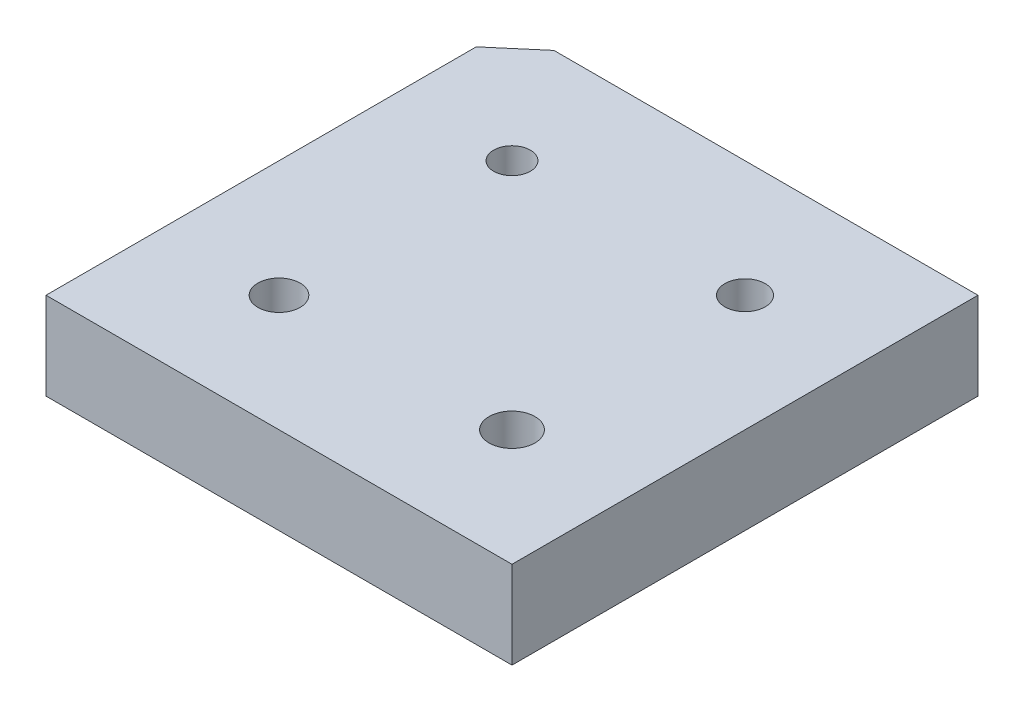
ISO-10303-21;
HEADER;
FILE_DESCRIPTION(('STEP AP214'),'2;1');
FILE_NAME('part.step','',(''),(''),'','','');
FILE_SCHEMA(('AUTOMOTIVE_DESIGN { 1 0 10303 214 1 1 1 1 }'));
ENDSEC;
DATA;
#1=APPLICATION_CONTEXT('core data for automotive mechanical design processes');
#2=APPLICATION_PROTOCOL_DEFINITION('international standard','automotive_design',2000,#1);
#3=PRODUCT_CONTEXT('',#1,'mechanical');
#4=PRODUCT('Part','Part','',(#3));
#5=PRODUCT_RELATED_PRODUCT_CATEGORY('part','',(#4));
#6=PRODUCT_DEFINITION_FORMATION('','',#4);
#7=PRODUCT_DEFINITION_CONTEXT('part definition',#1,'design');
#8=PRODUCT_DEFINITION('design','',#6,#7);
#9=PRODUCT_DEFINITION_SHAPE('','',#8);
#10=(LENGTH_UNIT() NAMED_UNIT(*) SI_UNIT(.MILLI.,.METRE.));
#11=(NAMED_UNIT(*) PLANE_ANGLE_UNIT() SI_UNIT($,.RADIAN.));
#12=(NAMED_UNIT(*) SI_UNIT($,.STERADIAN.) SOLID_ANGLE_UNIT());
#13=UNCERTAINTY_MEASURE_WITH_UNIT(LENGTH_MEASURE(1.E-05),#10,'distance_accuracy_value','');
#14=(GEOMETRIC_REPRESENTATION_CONTEXT(3) GLOBAL_UNCERTAINTY_ASSIGNED_CONTEXT((#13)) GLOBAL_UNIT_ASSIGNED_CONTEXT((#10,
#11,#12)) REPRESENTATION_CONTEXT('',''));
#15=CARTESIAN_POINT('',(0.,0.,0.));
#16=DIRECTION('',(0.,0.,1.));
#17=DIRECTION('',(1.,0.,0.));
#18=AXIS2_PLACEMENT_3D('',#15,#16,#17);
#19=CARTESIAN_POINT('',(0.,0.,0.));
#20=DIRECTION('',(0.,-1.,0.));
#21=DIRECTION('',(0.,0.,-1.));
#22=AXIS2_PLACEMENT_3D('',#19,#20,#21);
#23=PLANE('',#22);
#24=DIRECTION('',(0.760890464933615,0.,-0.648880343648278));
#25=VECTOR('',#24,1.);
#26=CARTESIAN_POINT('',(-12.7,0.,-10.7505847924545));
#27=LINE('',#26,#25);
#28=CARTESIAN_POINT('',(-12.7,0.,-10.7505847924545));
#29=VERTEX_POINT('',#28);
#30=CARTESIAN_POINT('',(-10.4140755485391,0.,-12.7));
#31=VERTEX_POINT('',#30);
#32=EDGE_CURVE('E154',#29,#31,#27,.T.);
#33=ORIENTED_EDGE('',*,*,#32,.T.);
#34=DIRECTION('',(-1.,0.,0.));
#35=VECTOR('',#34,1.);
#36=CARTESIAN_POINT('',(0.,0.,-12.7));
#37=LINE('',#36,#35);
#38=CARTESIAN_POINT('',(12.7,0.,-12.7));
#39=VERTEX_POINT('',#38);
#40=EDGE_CURVE('E166',#39,#31,#37,.T.);
#41=ORIENTED_EDGE('',*,*,#40,.F.);
#42=DIRECTION('',(0.,0.,-1.));
#43=VECTOR('',#42,1.);
#44=CARTESIAN_POINT('',(12.7,0.,0.));
#45=LINE('',#44,#43);
#46=CARTESIAN_POINT('',(12.7,0.,12.7));
#47=VERTEX_POINT('',#46);
#48=EDGE_CURVE('E176',#47,#39,#45,.T.);
#49=ORIENTED_EDGE('',*,*,#48,.F.);
#50=DIRECTION('',(-1.,0.,0.));
#51=VECTOR('',#50,1.);
#52=CARTESIAN_POINT('',(0.,0.,12.7));
#53=LINE('',#52,#51);
#54=CARTESIAN_POINT('',(-12.7,0.,12.7));
#55=VERTEX_POINT('',#54);
#56=EDGE_CURVE('E181',#47,#55,#53,.T.);
#57=ORIENTED_EDGE('',*,*,#56,.T.);
#58=DIRECTION('',(0.,0.,-1.));
#59=VECTOR('',#58,1.);
#60=CARTESIAN_POINT('',(-12.7,0.,0.));
#61=LINE('',#60,#59);
#62=EDGE_CURVE('E169',#55,#29,#61,.T.);
#63=ORIENTED_EDGE('',*,*,#62,.T.);
#64=EDGE_LOOP('',(#33,#41,#49,#57,#63));
#65=FACE_BOUND('',#64,.T.);
#66=CARTESIAN_POINT('',(6.35,0.,6.35));
#67=DIRECTION('',(0.,1.,0.));
#68=DIRECTION('',(0.,0.,1.));
#69=AXIS2_PLACEMENT_3D('',#66,#67,#68);
#70=CIRCLE('',#69,1.24968);
#71=CARTESIAN_POINT('',(6.35,0.,7.59968));
#72=VERTEX_POINT('',#71);
#73=EDGE_CURVE('E237',#72,#72,#70,.T.);
#74=ORIENTED_EDGE('',*,*,#73,.T.);
#75=EDGE_LOOP('',(#74));
#76=FACE_BOUND('',#75,.T.);
#77=CARTESIAN_POINT('',(-6.35,0.,6.35));
#78=DIRECTION('',(0.,1.,0.));
#79=DIRECTION('',(0.,0.,1.));
#80=AXIS2_PLACEMENT_3D('',#77,#78,#79);
#81=CIRCLE('',#80,1.15062);
#82=CARTESIAN_POINT('',(-6.35,0.,7.50062));
#83=VERTEX_POINT('',#82);
#84=EDGE_CURVE('E229',#83,#83,#81,.T.);
#85=ORIENTED_EDGE('',*,*,#84,.T.);
#86=EDGE_LOOP('',(#85));
#87=FACE_BOUND('',#86,.T.);
#88=CARTESIAN_POINT('',(6.35,0.,-6.35));
#89=DIRECTION('',(0.,1.,0.));
#90=DIRECTION('',(0.,0.,1.));
#91=AXIS2_PLACEMENT_3D('',#88,#89,#90);
#92=CIRCLE('',#91,1.09982);
#93=CARTESIAN_POINT('',(6.35,0.,-5.25018));
#94=VERTEX_POINT('',#93);
#95=EDGE_CURVE('E221',#94,#94,#92,.T.);
#96=ORIENTED_EDGE('',*,*,#95,.T.);
#97=EDGE_LOOP('',(#96));
#98=FACE_BOUND('',#97,.T.);
#99=CARTESIAN_POINT('',(-6.35,0.,-6.35));
#100=DIRECTION('',(0.,1.,0.));
#101=DIRECTION('',(0.,0.,1.));
#102=AXIS2_PLACEMENT_3D('',#99,#100,#101);
#103=CIRCLE('',#102,1.00076);
#104=CARTESIAN_POINT('',(-6.35,0.,-5.34924));
#105=VERTEX_POINT('',#104);
#106=EDGE_CURVE('E188',#105,#105,#103,.T.);
#107=ORIENTED_EDGE('',*,*,#106,.T.);
#108=EDGE_LOOP('',(#107));
#109=FACE_BOUND('',#108,.T.);
#110=ADVANCED_FACE('F105',(#65,#76,#87,#98,#109),#23,.T.);
#111=CARTESIAN_POINT('',(0.,0.,12.7));
#112=DIRECTION('',(0.,0.,-1.));
#113=DIRECTION('',(-1.,0.,0.));
#114=AXIS2_PLACEMENT_3D('',#111,#112,#113);
#115=PLANE('',#114);
#116=DIRECTION('',(-1.,0.,0.));
#117=VECTOR('',#116,1.);
#118=CARTESIAN_POINT('',(0.,4.7625,12.7));
#119=LINE('',#118,#117);
#120=CARTESIAN_POINT('',(12.7,4.7625,12.7));
#121=VERTEX_POINT('',#120);
#122=CARTESIAN_POINT('',(-12.7,4.7625,12.7));
#123=VERTEX_POINT('',#122);
#124=EDGE_CURVE('E129',#121,#123,#119,.T.);
#125=ORIENTED_EDGE('',*,*,#124,.T.);
#126=DIRECTION('',(0.,1.,0.));
#127=VECTOR('',#126,1.);
#128=CARTESIAN_POINT('',(-12.7,0.,12.7));
#129=LINE('',#128,#127);
#130=EDGE_CURVE('E108',#55,#123,#129,.T.);
#131=ORIENTED_EDGE('',*,*,#130,.F.);
#132=ORIENTED_EDGE('',*,*,#56,.F.);
#133=DIRECTION('',(0.,1.,0.));
#134=VECTOR('',#133,1.);
#135=CARTESIAN_POINT('',(12.7,0.,12.7));
#136=LINE('',#135,#134);
#137=EDGE_CURVE('E12',#47,#121,#136,.T.);
#138=ORIENTED_EDGE('',*,*,#137,.T.);
#139=EDGE_LOOP('',(#125,#131,#132,#138));
#140=FACE_BOUND('',#139,.T.);
#141=ADVANCED_FACE('F244',(#140),#115,.F.);
#142=CARTESIAN_POINT('',(12.7,0.,0.));
#143=DIRECTION('',(1.,0.,0.));
#144=DIRECTION('',(0.,0.,-1.));
#145=AXIS2_PLACEMENT_3D('',#142,#143,#144);
#146=PLANE('',#145);
#147=DIRECTION('',(0.,0.,-1.));
#148=VECTOR('',#147,1.);
#149=CARTESIAN_POINT('',(12.7,4.7625,0.));
#150=LINE('',#149,#148);
#151=CARTESIAN_POINT('',(12.7,4.7625,-12.7));
#152=VERTEX_POINT('',#151);
#153=EDGE_CURVE('E195',#121,#152,#150,.T.);
#154=ORIENTED_EDGE('',*,*,#153,.F.);
#155=ORIENTED_EDGE('',*,*,#137,.F.);
#156=ORIENTED_EDGE('',*,*,#48,.T.);
#157=DIRECTION('',(0.,1.,0.));
#158=VECTOR('',#157,1.);
#159=CARTESIAN_POINT('',(12.7,0.,-12.7));
#160=LINE('',#159,#158);
#161=EDGE_CURVE('E114',#39,#152,#160,.T.);
#162=ORIENTED_EDGE('',*,*,#161,.T.);
#163=EDGE_LOOP('',(#154,#155,#156,#162));
#164=FACE_BOUND('',#163,.T.);
#165=ADVANCED_FACE('F245',(#164),#146,.T.);
#166=CARTESIAN_POINT('',(0.,0.,-12.7));
#167=DIRECTION('',(0.,0.,-1.));
#168=DIRECTION('',(-1.,0.,0.));
#169=AXIS2_PLACEMENT_3D('',#166,#167,#168);
#170=PLANE('',#169);
#171=DIRECTION('',(0.,1.,0.));
#172=VECTOR('',#171,1.);
#173=CARTESIAN_POINT('',(-10.4140755485391,0.,-12.7));
#174=LINE('',#173,#172);
#175=CARTESIAN_POINT('',(-10.4140755485391,4.7625,-12.7));
#176=VERTEX_POINT('',#175);
#177=EDGE_CURVE('E151',#31,#176,#174,.T.);
#178=ORIENTED_EDGE('',*,*,#177,.T.);
#179=DIRECTION('',(-1.,0.,0.));
#180=VECTOR('',#179,1.);
#181=CARTESIAN_POINT('',(0.,4.7625,-12.7));
#182=LINE('',#181,#180);
#183=EDGE_CURVE('E192',#152,#176,#182,.T.);
#184=ORIENTED_EDGE('',*,*,#183,.F.);
#185=ORIENTED_EDGE('',*,*,#161,.F.);
#186=ORIENTED_EDGE('',*,*,#40,.T.);
#187=EDGE_LOOP('',(#178,#184,#185,#186));
#188=FACE_BOUND('',#187,.T.);
#189=ADVANCED_FACE('F173',(#188),#170,.T.);
#190=CARTESIAN_POINT('',(-12.7,0.,0.));
#191=DIRECTION('',(1.,0.,0.));
#192=DIRECTION('',(0.,0.,-1.));
#193=AXIS2_PLACEMENT_3D('',#190,#191,#192);
#194=PLANE('',#193);
#195=DIRECTION('',(0.,0.,-1.));
#196=VECTOR('',#195,1.);
#197=CARTESIAN_POINT('',(-12.7,4.7625,0.));
#198=LINE('',#197,#196);
#199=CARTESIAN_POINT('',(-12.7,4.7625,-10.7505847924545));
#200=VERTEX_POINT('',#199);
#201=EDGE_CURVE('E187',#123,#200,#198,.T.);
#202=ORIENTED_EDGE('',*,*,#201,.T.);
#203=DIRECTION('',(0.,1.,0.));
#204=VECTOR('',#203,1.);
#205=CARTESIAN_POINT('',(-12.7,0.,-10.7505847924545));
#206=LINE('',#205,#204);
#207=EDGE_CURVE('E122',#29,#200,#206,.T.);
#208=ORIENTED_EDGE('',*,*,#207,.F.);
#209=ORIENTED_EDGE('',*,*,#62,.F.);
#210=ORIENTED_EDGE('',*,*,#130,.T.);
#211=EDGE_LOOP('',(#202,#208,#209,#210));
#212=FACE_BOUND('',#211,.T.);
#213=ADVANCED_FACE('F204',(#212),#194,.F.);
#214=CARTESIAN_POINT('',(-6.35,0.,-6.35));
#215=DIRECTION('',(0.,1.,0.));
#216=DIRECTION('',(0.,0.,1.));
#217=AXIS2_PLACEMENT_3D('',#214,#215,#216);
#218=CYLINDRICAL_SURFACE('',#217,1.00076);
#219=ORIENTED_EDGE('',*,*,#106,.F.);
#220=EDGE_LOOP('',(#219));
#221=FACE_BOUND('',#220,.T.);
#222=CARTESIAN_POINT('',(-6.35,4.7625,-6.35));
#223=DIRECTION('',(0.,1.,0.));
#224=DIRECTION('',(0.,0.,1.));
#225=AXIS2_PLACEMENT_3D('',#222,#223,#224);
#226=CIRCLE('',#225,1.00076);
#227=CARTESIAN_POINT('',(-6.35,4.7625,-5.34924));
#228=VERTEX_POINT('',#227);
#229=EDGE_CURVE('E217',#228,#228,#226,.T.);
#230=ORIENTED_EDGE('',*,*,#229,.T.);
#231=EDGE_LOOP('',(#230));
#232=FACE_BOUND('',#231,.T.);
#233=ADVANCED_FACE('F278',(#221,#232),#218,.F.);
#234=CARTESIAN_POINT('',(6.35,0.,-6.35));
#235=DIRECTION('',(0.,1.,0.));
#236=DIRECTION('',(0.,0.,1.));
#237=AXIS2_PLACEMENT_3D('',#234,#235,#236);
#238=CYLINDRICAL_SURFACE('',#237,1.09982);
#239=ORIENTED_EDGE('',*,*,#95,.F.);
#240=EDGE_LOOP('',(#239));
#241=FACE_BOUND('',#240,.T.);
#242=CARTESIAN_POINT('',(6.35,4.7625,-6.35));
#243=DIRECTION('',(0.,1.,0.));
#244=DIRECTION('',(0.,0.,1.));
#245=AXIS2_PLACEMENT_3D('',#242,#243,#244);
#246=CIRCLE('',#245,1.09982);
#247=CARTESIAN_POINT('',(6.35,4.7625,-5.25018));
#248=VERTEX_POINT('',#247);
#249=EDGE_CURVE('E225',#248,#248,#246,.T.);
#250=ORIENTED_EDGE('',*,*,#249,.T.);
#251=EDGE_LOOP('',(#250));
#252=FACE_BOUND('',#251,.T.);
#253=ADVANCED_FACE('F308',(#241,#252),#238,.F.);
#254=CARTESIAN_POINT('',(-6.35,0.,6.35));
#255=DIRECTION('',(0.,1.,0.));
#256=DIRECTION('',(0.,0.,1.));
#257=AXIS2_PLACEMENT_3D('',#254,#255,#256);
#258=CYLINDRICAL_SURFACE('',#257,1.15062);
#259=ORIENTED_EDGE('',*,*,#84,.F.);
#260=EDGE_LOOP('',(#259));
#261=FACE_BOUND('',#260,.T.);
#262=CARTESIAN_POINT('',(-6.35,4.7625,6.35));
#263=DIRECTION('',(0.,1.,0.));
#264=DIRECTION('',(0.,0.,1.));
#265=AXIS2_PLACEMENT_3D('',#262,#263,#264);
#266=CIRCLE('',#265,1.15062);
#267=CARTESIAN_POINT('',(-6.35,4.7625,7.50062));
#268=VERTEX_POINT('',#267);
#269=EDGE_CURVE('E233',#268,#268,#266,.T.);
#270=ORIENTED_EDGE('',*,*,#269,.T.);
#271=EDGE_LOOP('',(#270));
#272=FACE_BOUND('',#271,.T.);
#273=ADVANCED_FACE('F301',(#261,#272),#258,.F.);
#274=CARTESIAN_POINT('',(6.35,0.,6.35));
#275=DIRECTION('',(0.,1.,0.));
#276=DIRECTION('',(0.,0.,1.));
#277=AXIS2_PLACEMENT_3D('',#274,#275,#276);
#278=CYLINDRICAL_SURFACE('',#277,1.24968);
#279=ORIENTED_EDGE('',*,*,#73,.F.);
#280=EDGE_LOOP('',(#279));
#281=FACE_BOUND('',#280,.T.);
#282=CARTESIAN_POINT('',(6.35,4.7625,6.35));
#283=DIRECTION('',(0.,1.,0.));
#284=DIRECTION('',(0.,0.,1.));
#285=AXIS2_PLACEMENT_3D('',#282,#283,#284);
#286=CIRCLE('',#285,1.24968);
#287=CARTESIAN_POINT('',(6.35,4.7625,7.59968));
#288=VERTEX_POINT('',#287);
#289=EDGE_CURVE('E212',#288,#288,#286,.T.);
#290=ORIENTED_EDGE('',*,*,#289,.T.);
#291=EDGE_LOOP('',(#290));
#292=FACE_BOUND('',#291,.T.);
#293=ADVANCED_FACE('F265',(#281,#292),#278,.F.);
#294=CARTESIAN_POINT('',(0.,4.7625,0.));
#295=DIRECTION('',(0.,-1.,0.));
#296=DIRECTION('',(0.,0.,-1.));
#297=AXIS2_PLACEMENT_3D('',#294,#295,#296);
#298=PLANE('',#297);
#299=ORIENTED_EDGE('',*,*,#289,.F.);
#300=EDGE_LOOP('',(#299));
#301=FACE_BOUND('',#300,.T.);
#302=ORIENTED_EDGE('',*,*,#269,.F.);
#303=EDGE_LOOP('',(#302));
#304=FACE_BOUND('',#303,.T.);
#305=ORIENTED_EDGE('',*,*,#249,.F.);
#306=EDGE_LOOP('',(#305));
#307=FACE_BOUND('',#306,.T.);
#308=ORIENTED_EDGE('',*,*,#229,.F.);
#309=EDGE_LOOP('',(#308));
#310=FACE_BOUND('',#309,.T.);
#311=ORIENTED_EDGE('',*,*,#183,.T.);
#312=DIRECTION('',(0.760890464933615,0.,-0.648880343648278));
#313=VECTOR('',#312,1.);
#314=CARTESIAN_POINT('',(-12.7,4.7625,-10.7505847924545));
#315=LINE('',#314,#313);
#316=EDGE_CURVE('E155',#200,#176,#315,.T.);
#317=ORIENTED_EDGE('',*,*,#316,.F.);
#318=ORIENTED_EDGE('',*,*,#201,.F.);
#319=ORIENTED_EDGE('',*,*,#124,.F.);
#320=ORIENTED_EDGE('',*,*,#153,.T.);
#321=EDGE_LOOP('',(#311,#317,#318,#319,#320));
#322=FACE_BOUND('',#321,.T.);
#323=ADVANCED_FACE('F207',(#301,#304,#307,#310,#322),#298,.F.);
#324=CARTESIAN_POINT('',(-12.7,0.,-10.7505847924545));
#325=DIRECTION('',(0.648880343648278,0.,0.760890464933614));
#326=DIRECTION('',(0.760890464933615,0.,-0.648880343648279));
#327=AXIS2_PLACEMENT_3D('',#324,#325,#326);
#328=PLANE('',#327);
#329=ORIENTED_EDGE('',*,*,#316,.T.);
#330=ORIENTED_EDGE('',*,*,#177,.F.);
#331=ORIENTED_EDGE('',*,*,#32,.F.);
#332=ORIENTED_EDGE('',*,*,#207,.T.);
#333=EDGE_LOOP('',(#329,#330,#331,#332));
#334=FACE_BOUND('',#333,.T.);
#335=ADVANCED_FACE('F153',(#334),#328,.F.);
#336=CLOSED_SHELL('',(#110,#141,#165,#189,#213,#233,#253,#273,#293,#323,#335));
#337=MANIFOLD_SOLID_BREP('B2',#336);
#338=ADVANCED_BREP_SHAPE_REPRESENTATION('',(#18,#337),#14);
#339=SHAPE_DEFINITION_REPRESENTATION(#9,#338);
ENDSEC;
END-ISO-10303-21;
